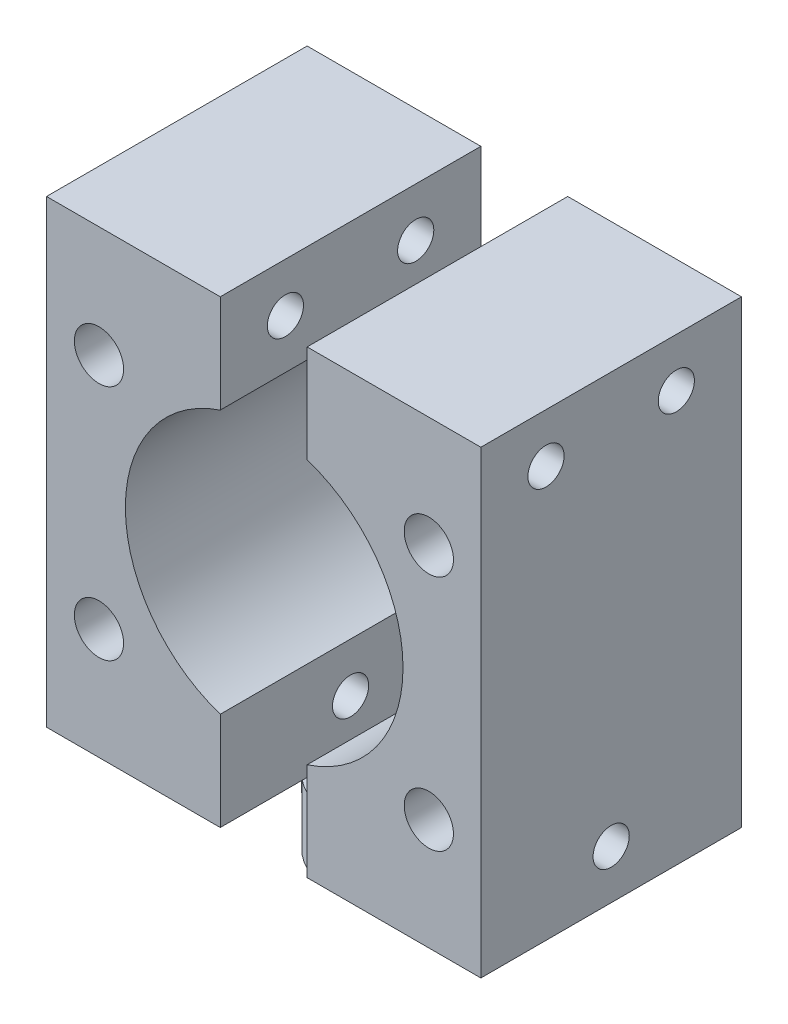
ISO-10303-21;
HEADER;
FILE_DESCRIPTION(('STEP AP214'),'2;1');
FILE_NAME('part.step','',(''),(''),'','','');
FILE_SCHEMA(('AUTOMOTIVE_DESIGN { 1 0 10303 214 1 1 1 1 }'));
ENDSEC;
DATA;
#1=APPLICATION_CONTEXT('core data for automotive mechanical design processes');
#2=APPLICATION_PROTOCOL_DEFINITION('international standard','automotive_design',2000,#1);
#3=PRODUCT_CONTEXT('',#1,'mechanical');
#4=PRODUCT('Part','Part','',(#3));
#5=PRODUCT_RELATED_PRODUCT_CATEGORY('part','',(#4));
#6=PRODUCT_DEFINITION_FORMATION('','',#4);
#7=PRODUCT_DEFINITION_CONTEXT('part definition',#1,'design');
#8=PRODUCT_DEFINITION('design','',#6,#7);
#9=PRODUCT_DEFINITION_SHAPE('','',#8);
#10=(LENGTH_UNIT() NAMED_UNIT(*) SI_UNIT(.MILLI.,.METRE.));
#11=(NAMED_UNIT(*) PLANE_ANGLE_UNIT() SI_UNIT($,.RADIAN.));
#12=(NAMED_UNIT(*) SI_UNIT($,.STERADIAN.) SOLID_ANGLE_UNIT());
#13=UNCERTAINTY_MEASURE_WITH_UNIT(LENGTH_MEASURE(1.E-05),#10,'distance_accuracy_value','');
#14=(GEOMETRIC_REPRESENTATION_CONTEXT(3) GLOBAL_UNCERTAINTY_ASSIGNED_CONTEXT((#13)) GLOBAL_UNIT_ASSIGNED_CONTEXT((#10,
#11,#12)) REPRESENTATION_CONTEXT('',''));
#15=CARTESIAN_POINT('',(0.,0.,0.));
#16=DIRECTION('',(0.,0.,1.));
#17=DIRECTION('',(1.,0.,0.));
#18=AXIS2_PLACEMENT_3D('',#15,#16,#17);
#19=CARTESIAN_POINT('',(-15.,4.5,-8.65612108217187));
#20=DIRECTION('',(0.,-1.,0.));
#21=DIRECTION('',(0.,0.,-1.));
#22=AXIS2_PLACEMENT_3D('',#19,#20,#21);
#23=PLANE('',#22);
#24=DIRECTION('',(0.,0.,-1.));
#25=VECTOR('',#24,1.);
#26=CARTESIAN_POINT('',(-3.,4.5,-8.65612108217187));
#27=LINE('',#26,#25);
#28=CARTESIAN_POINT('',(-3.,4.5,-3.68272996566406));
#29=VERTEX_POINT('',#28);
#30=CARTESIAN_POINT('',(-3.,4.5,-8.65612108217187));
#31=VERTEX_POINT('',#30);
#32=EDGE_CURVE('E209',#29,#31,#27,.T.);
#33=ORIENTED_EDGE('',*,*,#32,.F.);
#34=CARTESIAN_POINT('',(0.,4.5,0.));
#35=DIRECTION('',(0.,1.,0.));
#36=DIRECTION('',(0.,0.,1.));
#37=AXIS2_PLACEMENT_3D('',#34,#35,#36);
#38=CIRCLE('',#37,4.75);
#39=CARTESIAN_POINT('',(-3.,4.5,3.68272996566406));
#40=VERTEX_POINT('',#39);
#41=EDGE_CURVE('E146',#29,#40,#38,.T.);
#42=ORIENTED_EDGE('',*,*,#41,.T.);
#43=CARTESIAN_POINT('',(-3.,4.5,9.34387891782813));
#44=VERTEX_POINT('',#43);
#45=EDGE_CURVE('E199',#44,#40,#27,.T.);
#46=ORIENTED_EDGE('',*,*,#45,.F.);
#47=DIRECTION('',(1.,0.,0.));
#48=VECTOR('',#47,1.);
#49=CARTESIAN_POINT('',(-3.,4.5,9.34387891782813));
#50=LINE('',#49,#48);
#51=CARTESIAN_POINT('',(-15.,4.5,9.34387891782813));
#52=VERTEX_POINT('',#51);
#53=EDGE_CURVE('E208',#52,#44,#50,.T.);
#54=ORIENTED_EDGE('',*,*,#53,.F.);
#55=DIRECTION('',(0.,0.,1.));
#56=VECTOR('',#55,1.);
#57=CARTESIAN_POINT('',(-15.,4.5,9.34387891782813));
#58=LINE('',#57,#56);
#59=CARTESIAN_POINT('',(-15.,4.5,-8.65612108217187));
#60=VERTEX_POINT('',#59);
#61=EDGE_CURVE('E206',#60,#52,#58,.T.);
#62=ORIENTED_EDGE('',*,*,#61,.F.);
#63=DIRECTION('',(-1.,0.,0.));
#64=VECTOR('',#63,1.);
#65=CARTESIAN_POINT('',(-3.,4.5,-8.65612108217187));
#66=LINE('',#65,#64);
#67=EDGE_CURVE('E194',#31,#60,#66,.T.);
#68=ORIENTED_EDGE('',*,*,#67,.F.);
#69=EDGE_LOOP('',(#33,#42,#46,#54,#62,#68));
#70=FACE_BOUND('',#69,.T.);
#71=ADVANCED_FACE('F41',(#70),#23,.T.);
#72=CARTESIAN_POINT('',(-3.,36.25,-8.65612108217187));
#73=DIRECTION('',(0.,0.,1.));
#74=DIRECTION('',(1.,0.,0.));
#75=AXIS2_PLACEMENT_3D('',#72,#73,#74);
#76=PLANE('',#75);
#77=CARTESIAN_POINT('',(-11.3772186390947,28.569859147129,-8.65612108217187));
#78=DIRECTION('',(0.,0.,1.));
#79=DIRECTION('',(1.,0.,0.));
#80=AXIS2_PLACEMENT_3D('',#77,#78,#79);
#81=CIRCLE('',#80,1.7);
#82=CARTESIAN_POINT('',(-9.67721863909473,28.569859147129,-8.65612108217187));
#83=VERTEX_POINT('',#82);
#84=EDGE_CURVE('E169',#83,#83,#81,.T.);
#85=ORIENTED_EDGE('',*,*,#84,.T.);
#86=EDGE_LOOP('',(#85));
#87=FACE_BOUND('',#86,.T.);
#88=CARTESIAN_POINT('',(-11.3772186390947,12.180140852871,-8.65612108217187));
#89=DIRECTION('',(0.,0.,1.));
#90=DIRECTION('',(1.,0.,0.));
#91=AXIS2_PLACEMENT_3D('',#88,#89,#90);
#92=CIRCLE('',#91,1.7);
#93=CARTESIAN_POINT('',(-9.67721863909473,12.180140852871,-8.65612108217187));
#94=VERTEX_POINT('',#93);
#95=EDGE_CURVE('E130',#94,#94,#92,.T.);
#96=ORIENTED_EDGE('',*,*,#95,.T.);
#97=EDGE_LOOP('',(#96));
#98=FACE_BOUND('',#97,.T.);
#99=ORIENTED_EDGE('',*,*,#67,.T.);
#100=DIRECTION('',(0.,-1.,0.));
#101=VECTOR('',#100,1.);
#102=CARTESIAN_POINT('',(-15.,36.25,-8.65612108217187));
#103=LINE('',#102,#101);
#104=CARTESIAN_POINT('',(-15.,36.25,-8.65612108217187));
#105=VERTEX_POINT('',#104);
#106=EDGE_CURVE('E138',#105,#60,#103,.T.);
#107=ORIENTED_EDGE('',*,*,#106,.F.);
#108=DIRECTION('',(-1.,0.,0.));
#109=VECTOR('',#108,1.);
#110=CARTESIAN_POINT('',(-3.,36.25,-8.65612108217187));
#111=LINE('',#110,#109);
#112=CARTESIAN_POINT('',(-3.,36.25,-8.65612108217187));
#113=VERTEX_POINT('',#112);
#114=EDGE_CURVE('E195',#113,#105,#111,.T.);
#115=ORIENTED_EDGE('',*,*,#114,.F.);
#116=DIRECTION('',(0.,-1.,0.));
#117=VECTOR('',#116,1.);
#118=CARTESIAN_POINT('',(-3.,36.25,-8.65612108217187));
#119=LINE('',#118,#117);
#120=EDGE_CURVE('E140',#113,#31,#119,.T.);
#121=ORIENTED_EDGE('',*,*,#120,.T.);
#122=EDGE_LOOP('',(#99,#107,#115,#121));
#123=FACE_BOUND('',#122,.T.);
#124=ADVANCED_FACE('F43',(#87,#98,#123),#76,.F.);
#125=CARTESIAN_POINT('',(-15.,36.25,9.34387891782813));
#126=DIRECTION('',(1.,0.,0.));
#127=DIRECTION('',(0.,0.,-1.));
#128=AXIS2_PLACEMENT_3D('',#125,#126,#127);
#129=PLANE('',#128);
#130=CARTESIAN_POINT('',(-15.,32.8715786406462,4.84387891782813));
#131=DIRECTION('',(1.,0.,0.));
#132=DIRECTION('',(0.,0.,-1.));
#133=AXIS2_PLACEMENT_3D('',#130,#131,#132);
#134=CIRCLE('',#133,1.24999999999998);
#135=CARTESIAN_POINT('',(-15.,32.8715786406462,3.59387891782815));
#136=VERTEX_POINT('',#135);
#137=EDGE_CURVE('E164',#136,#136,#134,.T.);
#138=ORIENTED_EDGE('',*,*,#137,.T.);
#139=EDGE_LOOP('',(#138));
#140=FACE_BOUND('',#139,.T.);
#141=CARTESIAN_POINT('',(-15.,32.8715786406462,-4.15612108217187));
#142=DIRECTION('',(1.,0.,0.));
#143=DIRECTION('',(0.,0.,-1.));
#144=AXIS2_PLACEMENT_3D('',#141,#142,#143);
#145=CIRCLE('',#144,1.24999999999998);
#146=CARTESIAN_POINT('',(-15.,32.8715786406462,-5.40612108217185));
#147=VERTEX_POINT('',#146);
#148=EDGE_CURVE('E154',#147,#147,#145,.T.);
#149=ORIENTED_EDGE('',*,*,#148,.T.);
#150=EDGE_LOOP('',(#149));
#151=FACE_BOUND('',#150,.T.);
#152=CARTESIAN_POINT('',(-15.,7.87842135935374,0.34387891782813));
#153=DIRECTION('',(1.,0.,0.));
#154=DIRECTION('',(0.,0.,-1.));
#155=AXIS2_PLACEMENT_3D('',#152,#153,#154);
#156=CIRCLE('',#155,1.24999999999998);
#157=CARTESIAN_POINT('',(-15.,7.87842135935374,-0.906121082171854));
#158=VERTEX_POINT('',#157);
#159=EDGE_CURVE('E151',#158,#158,#156,.T.);
#160=ORIENTED_EDGE('',*,*,#159,.T.);
#161=EDGE_LOOP('',(#160));
#162=FACE_BOUND('',#161,.T.);
#163=ORIENTED_EDGE('',*,*,#61,.T.);
#164=DIRECTION('',(0.,-1.,0.));
#165=VECTOR('',#164,1.);
#166=CARTESIAN_POINT('',(-15.,36.25,9.34387891782813));
#167=LINE('',#166,#165);
#168=CARTESIAN_POINT('',(-15.,36.25,9.34387891782813));
#169=VERTEX_POINT('',#168);
#170=EDGE_CURVE('E135',#169,#52,#167,.T.);
#171=ORIENTED_EDGE('',*,*,#170,.F.);
#172=DIRECTION('',(0.,0.,1.));
#173=VECTOR('',#172,1.);
#174=CARTESIAN_POINT('',(-15.,36.25,9.34387891782813));
#175=LINE('',#174,#173);
#176=EDGE_CURVE('E198',#105,#169,#175,.T.);
#177=ORIENTED_EDGE('',*,*,#176,.F.);
#178=ORIENTED_EDGE('',*,*,#106,.T.);
#179=EDGE_LOOP('',(#163,#171,#177,#178));
#180=FACE_BOUND('',#179,.T.);
#181=ADVANCED_FACE('F225',(#140,#151,#162,#180),#129,.F.);
#182=CARTESIAN_POINT('',(-3.,36.25,9.34387891782813));
#183=DIRECTION('',(0.,0.,-1.));
#184=DIRECTION('',(-1.,0.,0.));
#185=AXIS2_PLACEMENT_3D('',#182,#183,#184);
#186=PLANE('',#185);
#187=CARTESIAN_POINT('',(-11.3772186390947,28.569859147129,9.34387891782813));
#188=DIRECTION('',(0.,0.,1.));
#189=DIRECTION('',(1.,0.,0.));
#190=AXIS2_PLACEMENT_3D('',#187,#188,#189);
#191=CIRCLE('',#190,1.69999999999999);
#192=CARTESIAN_POINT('',(-9.67721863909474,28.569859147129,9.34387891782813));
#193=VERTEX_POINT('',#192);
#194=EDGE_CURVE('E150',#193,#193,#191,.T.);
#195=ORIENTED_EDGE('',*,*,#194,.F.);
#196=EDGE_LOOP('',(#195));
#197=FACE_BOUND('',#196,.T.);
#198=CARTESIAN_POINT('',(-11.3772186390947,12.180140852871,9.34387891782813));
#199=DIRECTION('',(0.,0.,1.));
#200=DIRECTION('',(1.,0.,0.));
#201=AXIS2_PLACEMENT_3D('',#198,#199,#200);
#202=CIRCLE('',#201,1.69999999999999);
#203=CARTESIAN_POINT('',(-9.67721863909474,12.180140852871,9.34387891782813));
#204=VERTEX_POINT('',#203);
#205=EDGE_CURVE('E172',#204,#204,#202,.T.);
#206=ORIENTED_EDGE('',*,*,#205,.F.);
#207=EDGE_LOOP('',(#206));
#208=FACE_BOUND('',#207,.T.);
#209=DIRECTION('',(0.,-1.,0.));
#210=VECTOR('',#209,1.);
#211=CARTESIAN_POINT('',(-3.,36.25,9.34387891782813));
#212=LINE('',#211,#210);
#213=CARTESIAN_POINT('',(-3.,11.2790892751317,9.34387891782813));
#214=VERTEX_POINT('',#213);
#215=EDGE_CURVE('E129',#214,#44,#212,.T.);
#216=ORIENTED_EDGE('',*,*,#215,.F.);
#217=CARTESIAN_POINT('',(0.0337666909677441,20.375,9.34387891782813));
#218=DIRECTION('',(0.,0.,1.));
#219=DIRECTION('',(1.,0.,0.));
#220=AXIS2_PLACEMENT_3D('',#217,#218,#219);
#221=CIRCLE('',#220,9.5885);
#222=CARTESIAN_POINT('',(-3.,29.4709107248683,9.34387891782813));
#223=VERTEX_POINT('',#222);
#224=EDGE_CURVE('E115',#223,#214,#221,.T.);
#225=ORIENTED_EDGE('',*,*,#224,.F.);
#226=CARTESIAN_POINT('',(-3.,36.25,9.34387891782813));
#227=VERTEX_POINT('',#226);
#228=EDGE_CURVE('E126',#227,#223,#212,.T.);
#229=ORIENTED_EDGE('',*,*,#228,.F.);
#230=DIRECTION('',(1.,0.,0.));
#231=VECTOR('',#230,1.);
#232=CARTESIAN_POINT('',(-3.,36.25,9.34387891782813));
#233=LINE('',#232,#231);
#234=EDGE_CURVE('E201',#169,#227,#233,.T.);
#235=ORIENTED_EDGE('',*,*,#234,.F.);
#236=ORIENTED_EDGE('',*,*,#170,.T.);
#237=ORIENTED_EDGE('',*,*,#53,.T.);
#238=EDGE_LOOP('',(#216,#225,#229,#235,#236,#237));
#239=FACE_BOUND('',#238,.T.);
#240=ADVANCED_FACE('F124',(#197,#208,#239),#186,.F.);
#241=CARTESIAN_POINT('',(-3.,36.25,-8.65612108217187));
#242=DIRECTION('',(-1.,0.,0.));
#243=DIRECTION('',(0.,0.,1.));
#244=AXIS2_PLACEMENT_3D('',#241,#242,#243);
#245=PLANE('',#244);
#246=CARTESIAN_POINT('',(-3.,32.8715786406462,4.84387891782813));
#247=DIRECTION('',(-1.,0.,0.));
#248=DIRECTION('',(0.,0.,1.));
#249=AXIS2_PLACEMENT_3D('',#246,#247,#248);
#250=CIRCLE('',#249,1.24999999999998);
#251=CARTESIAN_POINT('',(-3.,32.8715786406462,6.09387891782811));
#252=VERTEX_POINT('',#251);
#253=EDGE_CURVE('E45',#252,#252,#250,.T.);
#254=ORIENTED_EDGE('',*,*,#253,.T.);
#255=EDGE_LOOP('',(#254));
#256=FACE_BOUND('',#255,.T.);
#257=CARTESIAN_POINT('',(-3.,32.8715786406462,-4.15612108217187));
#258=DIRECTION('',(-1.,0.,0.));
#259=DIRECTION('',(0.,0.,1.));
#260=AXIS2_PLACEMENT_3D('',#257,#258,#259);
#261=CIRCLE('',#260,1.24999999999998);
#262=CARTESIAN_POINT('',(-3.,32.8715786406462,-2.90612108217189));
#263=VERTEX_POINT('',#262);
#264=EDGE_CURVE('E152',#263,#263,#261,.T.);
#265=ORIENTED_EDGE('',*,*,#264,.T.);
#266=EDGE_LOOP('',(#265));
#267=FACE_BOUND('',#266,.T.);
#268=CARTESIAN_POINT('',(-3.,7.87842135935374,0.34387891782813));
#269=DIRECTION('',(-1.,0.,0.));
#270=DIRECTION('',(0.,0.,1.));
#271=AXIS2_PLACEMENT_3D('',#268,#269,#270);
#272=CIRCLE('',#271,1.24999999999999);
#273=CARTESIAN_POINT('',(-3.,7.87842135935374,1.59387891782812));
#274=VERTEX_POINT('',#273);
#275=EDGE_CURVE('E148',#274,#274,#272,.T.);
#276=ORIENTED_EDGE('',*,*,#275,.T.);
#277=EDGE_LOOP('',(#276));
#278=FACE_BOUND('',#277,.T.);
#279=DIRECTION('',(0.,1.,0.));
#280=VECTOR('',#279,1.);
#281=CARTESIAN_POINT('',(-3.,36.25,-7.65612108217187));
#282=LINE('',#281,#280);
#283=CARTESIAN_POINT('',(-3.,11.2790892751317,-7.65612108217187));
#284=VERTEX_POINT('',#283);
#285=CARTESIAN_POINT('',(-3.,29.4709107248683,-7.65612108217187));
#286=VERTEX_POINT('',#285);
#287=EDGE_CURVE('E119',#284,#286,#282,.T.);
#288=ORIENTED_EDGE('',*,*,#287,.F.);
#289=DIRECTION('',(0.,0.,1.));
#290=VECTOR('',#289,1.);
#291=CARTESIAN_POINT('',(-3.,11.2790892751317,-7.65612108217187));
#292=LINE('',#291,#290);
#293=EDGE_CURVE('E12',#284,#214,#292,.T.);
#294=ORIENTED_EDGE('',*,*,#293,.T.);
#295=ORIENTED_EDGE('',*,*,#215,.T.);
#296=ORIENTED_EDGE('',*,*,#45,.T.);
#297=EDGE_CURVE('E211',#40,#29,#27,.T.);
#298=ORIENTED_EDGE('',*,*,#297,.T.);
#299=ORIENTED_EDGE('',*,*,#32,.T.);
#300=ORIENTED_EDGE('',*,*,#120,.F.);
#301=DIRECTION('',(0.,0.,-1.));
#302=VECTOR('',#301,1.);
#303=CARTESIAN_POINT('',(-3.,36.25,-8.65612108217187));
#304=LINE('',#303,#302);
#305=EDGE_CURVE('E134',#227,#113,#304,.T.);
#306=ORIENTED_EDGE('',*,*,#305,.F.);
#307=ORIENTED_EDGE('',*,*,#228,.T.);
#308=DIRECTION('',(0.,0.,1.));
#309=VECTOR('',#308,1.);
#310=CARTESIAN_POINT('',(-3.,29.4709107248683,-7.65612108217187));
#311=LINE('',#310,#309);
#312=EDGE_CURVE('E50',#223,#286,#311,.F.);
#313=ORIENTED_EDGE('',*,*,#312,.T.);
#314=EDGE_LOOP('',(#288,#294,#295,#296,#298,#299,#300,#306,#307,#313));
#315=FACE_BOUND('',#314,.T.);
#316=ADVANCED_FACE('F132',(#256,#267,#278,#315),#245,.F.);
#317=CARTESIAN_POINT('',(-15.,36.25,-8.65612108217187));
#318=DIRECTION('',(0.,-1.,0.));
#319=DIRECTION('',(0.,0.,-1.));
#320=AXIS2_PLACEMENT_3D('',#317,#318,#319);
#321=PLANE('',#320);
#322=ORIENTED_EDGE('',*,*,#114,.T.);
#323=ORIENTED_EDGE('',*,*,#176,.T.);
#324=ORIENTED_EDGE('',*,*,#234,.T.);
#325=ORIENTED_EDGE('',*,*,#305,.T.);
#326=EDGE_LOOP('',(#322,#323,#324,#325));
#327=FACE_BOUND('',#326,.T.);
#328=ADVANCED_FACE('F227',(#327),#321,.F.);
#329=CARTESIAN_POINT('',(-10.5914213562373,4.5,0.));
#330=DIRECTION('',(0.,1.,0.));
#331=DIRECTION('',(0.,0.,1.));
#332=AXIS2_PLACEMENT_3D('',#329,#330,#331);
#333=PLANE('',#332);
#334=ORIENTED_EDGE('',*,*,#297,.F.);
#335=CARTESIAN_POINT('',(-1.5,4.5,4.50693909432999));
#336=VERTEX_POINT('',#335);
#337=EDGE_CURVE('E65',#40,#336,#38,.T.);
#338=ORIENTED_EDGE('',*,*,#337,.T.);
#339=DIRECTION('',(0.,0.,1.));
#340=VECTOR('',#339,1.);
#341=CARTESIAN_POINT('',(-1.5,4.5,0.));
#342=LINE('',#341,#340);
#343=CARTESIAN_POINT('',(-1.5,4.5,-4.50693909432999));
#344=VERTEX_POINT('',#343);
#345=EDGE_CURVE('E179',#344,#336,#342,.T.);
#346=ORIENTED_EDGE('',*,*,#345,.F.);
#347=EDGE_CURVE('E183',#344,#29,#38,.T.);
#348=ORIENTED_EDGE('',*,*,#347,.T.);
#349=EDGE_LOOP('',(#334,#338,#346,#348));
#350=FACE_BOUND('',#349,.T.);
#351=ADVANCED_FACE('F231',(#350),#333,.T.);
#352=CARTESIAN_POINT('',(-1.5,4.5,0.));
#353=DIRECTION('',(1.,0.,0.));
#354=DIRECTION('',(0.,0.,-1.));
#355=AXIS2_PLACEMENT_3D('',#352,#353,#354);
#356=PLANE('',#355);
#357=DIRECTION('',(0.,0.,1.));
#358=VECTOR('',#357,1.);
#359=CARTESIAN_POINT('',(-1.5,0.,0.));
#360=LINE('',#359,#358);
#361=CARTESIAN_POINT('',(-1.5,0.,-4.50693909432999));
#362=VERTEX_POINT('',#361);
#363=CARTESIAN_POINT('',(-1.5,0.,4.50693909432999));
#364=VERTEX_POINT('',#363);
#365=EDGE_CURVE('E177',#362,#364,#360,.T.);
#366=ORIENTED_EDGE('',*,*,#365,.F.);
#367=DIRECTION('',(0.,-1.,0.));
#368=VECTOR('',#367,1.);
#369=CARTESIAN_POINT('',(-1.5,4.5,-4.50693909432999));
#370=LINE('',#369,#368);
#371=EDGE_CURVE('E192',#344,#362,#370,.T.);
#372=ORIENTED_EDGE('',*,*,#371,.F.);
#373=ORIENTED_EDGE('',*,*,#345,.T.);
#374=DIRECTION('',(0.,-1.,0.));
#375=VECTOR('',#374,1.);
#376=CARTESIAN_POINT('',(-1.5,4.5,4.50693909432999));
#377=LINE('',#376,#375);
#378=EDGE_CURVE('E186',#336,#364,#377,.T.);
#379=ORIENTED_EDGE('',*,*,#378,.T.);
#380=EDGE_LOOP('',(#366,#372,#373,#379));
#381=FACE_BOUND('',#380,.T.);
#382=ADVANCED_FACE('F236',(#381),#356,.T.);
#383=CARTESIAN_POINT('',(0.,4.5,0.));
#384=DIRECTION('',(0.,-1.,0.));
#385=DIRECTION('',(0.,0.,-1.));
#386=AXIS2_PLACEMENT_3D('',#383,#384,#385);
#387=CYLINDRICAL_SURFACE('',#386,4.75);
#388=CARTESIAN_POINT('',(0.,0.,0.));
#389=DIRECTION('',(0.,1.,0.));
#390=DIRECTION('',(0.,0.,1.));
#391=AXIS2_PLACEMENT_3D('',#388,#389,#390);
#392=CIRCLE('',#391,4.75);
#393=EDGE_CURVE('E182',#362,#364,#392,.T.);
#394=ORIENTED_EDGE('',*,*,#393,.T.);
#395=ORIENTED_EDGE('',*,*,#378,.F.);
#396=ORIENTED_EDGE('',*,*,#337,.F.);
#397=ORIENTED_EDGE('',*,*,#41,.F.);
#398=ORIENTED_EDGE('',*,*,#347,.F.);
#399=ORIENTED_EDGE('',*,*,#371,.T.);
#400=EDGE_LOOP('',(#394,#395,#396,#397,#398,#399));
#401=FACE_BOUND('',#400,.T.);
#402=ADVANCED_FACE('F232',(#401),#387,.T.);
#403=CARTESIAN_POINT('',(-10.5914213562373,0.,0.));
#404=DIRECTION('',(0.,1.,0.));
#405=DIRECTION('',(0.,0.,1.));
#406=AXIS2_PLACEMENT_3D('',#403,#404,#405);
#407=PLANE('',#406);
#408=ORIENTED_EDGE('',*,*,#365,.T.);
#409=ORIENTED_EDGE('',*,*,#393,.F.);
#410=EDGE_LOOP('',(#408,#409));
#411=FACE_BOUND('',#410,.T.);
#412=ADVANCED_FACE('F238',(#411),#407,.F.);
#413=CARTESIAN_POINT('',(0.0337666909677441,20.375,-7.65612108217187));
#414=DIRECTION('',(0.,0.,1.));
#415=DIRECTION('',(1.,0.,0.));
#416=AXIS2_PLACEMENT_3D('',#413,#414,#415);
#417=CYLINDRICAL_SURFACE('',#416,9.5885);
#418=CARTESIAN_POINT('',(0.0337666909677441,20.375,-7.65612108217187));
#419=DIRECTION('',(0.,0.,1.));
#420=DIRECTION('',(1.,0.,0.));
#421=AXIS2_PLACEMENT_3D('',#418,#419,#420);
#422=CIRCLE('',#421,9.5885);
#423=EDGE_CURVE('E57',#286,#284,#422,.T.);
#424=ORIENTED_EDGE('',*,*,#423,.F.);
#425=ORIENTED_EDGE('',*,*,#312,.F.);
#426=ORIENTED_EDGE('',*,*,#224,.T.);
#427=ORIENTED_EDGE('',*,*,#293,.F.);
#428=EDGE_LOOP('',(#424,#425,#426,#427));
#429=FACE_BOUND('',#428,.T.);
#430=ADVANCED_FACE('F114',(#429),#417,.F.);
#431=CARTESIAN_POINT('',(0.0337666909677441,20.375,-7.65612108217187));
#432=DIRECTION('',(0.,0.,1.));
#433=DIRECTION('',(1.,0.,0.));
#434=AXIS2_PLACEMENT_3D('',#431,#432,#433);
#435=PLANE('',#434);
#436=ORIENTED_EDGE('',*,*,#287,.T.);
#437=ORIENTED_EDGE('',*,*,#423,.T.);
#438=EDGE_LOOP('',(#436,#437));
#439=FACE_BOUND('',#438,.T.);
#440=ADVANCED_FACE('F245',(#439),#435,.T.);
#441=CARTESIAN_POINT('',(-11.3772186390947,12.180140852871,9.34387891782813));
#442=DIRECTION('',(0.,0.,1.));
#443=DIRECTION('',(1.,0.,0.));
#444=AXIS2_PLACEMENT_3D('',#441,#442,#443);
#445=CYLINDRICAL_SURFACE('',#444,1.69999999999999);
#446=ORIENTED_EDGE('',*,*,#95,.F.);
#447=EDGE_LOOP('',(#446));
#448=FACE_BOUND('',#447,.T.);
#449=ORIENTED_EDGE('',*,*,#205,.T.);
#450=EDGE_LOOP('',(#449));
#451=FACE_BOUND('',#450,.T.);
#452=ADVANCED_FACE('F287',(#448,#451),#445,.F.);
#453=CARTESIAN_POINT('',(-11.3772186390947,28.569859147129,9.34387891782813));
#454=DIRECTION('',(0.,0.,1.));
#455=DIRECTION('',(1.,0.,0.));
#456=AXIS2_PLACEMENT_3D('',#453,#454,#455);
#457=CYLINDRICAL_SURFACE('',#456,1.69999999999999);
#458=ORIENTED_EDGE('',*,*,#84,.F.);
#459=EDGE_LOOP('',(#458));
#460=FACE_BOUND('',#459,.T.);
#461=ORIENTED_EDGE('',*,*,#194,.T.);
#462=EDGE_LOOP('',(#461));
#463=FACE_BOUND('',#462,.T.);
#464=ADVANCED_FACE('F276',(#460,#463),#457,.F.);
#465=CARTESIAN_POINT('',(15.,7.87842135935374,0.34387891782813));
#466=DIRECTION('',(1.,0.,0.));
#467=DIRECTION('',(0.,0.,-1.));
#468=AXIS2_PLACEMENT_3D('',#465,#466,#467);
#469=CYLINDRICAL_SURFACE('',#468,1.24999999999999);
#470=ORIENTED_EDGE('',*,*,#159,.F.);
#471=EDGE_LOOP('',(#470));
#472=FACE_BOUND('',#471,.T.);
#473=ORIENTED_EDGE('',*,*,#275,.F.);
#474=EDGE_LOOP('',(#473));
#475=FACE_BOUND('',#474,.T.);
#476=ADVANCED_FACE('F272',(#472,#475),#469,.F.);
#477=CARTESIAN_POINT('',(15.,32.8715786406462,-4.15612108217187));
#478=DIRECTION('',(1.,0.,0.));
#479=DIRECTION('',(0.,0.,-1.));
#480=AXIS2_PLACEMENT_3D('',#477,#478,#479);
#481=CYLINDRICAL_SURFACE('',#480,1.24999999999998);
#482=ORIENTED_EDGE('',*,*,#148,.F.);
#483=EDGE_LOOP('',(#482));
#484=FACE_BOUND('',#483,.T.);
#485=ORIENTED_EDGE('',*,*,#264,.F.);
#486=EDGE_LOOP('',(#485));
#487=FACE_BOUND('',#486,.T.);
#488=ADVANCED_FACE('F275',(#484,#487),#481,.F.);
#489=CARTESIAN_POINT('',(15.,32.8715786406462,4.84387891782813));
#490=DIRECTION('',(1.,0.,0.));
#491=DIRECTION('',(0.,0.,-1.));
#492=AXIS2_PLACEMENT_3D('',#489,#490,#491);
#493=CYLINDRICAL_SURFACE('',#492,1.24999999999998);
#494=ORIENTED_EDGE('',*,*,#137,.F.);
#495=EDGE_LOOP('',(#494));
#496=FACE_BOUND('',#495,.T.);
#497=ORIENTED_EDGE('',*,*,#253,.F.);
#498=EDGE_LOOP('',(#497));
#499=FACE_BOUND('',#498,.T.);
#500=ADVANCED_FACE('F284',(#496,#499),#493,.F.);
#501=CLOSED_SHELL('',(#71,#124,#181,#240,#316,#328,#351,#382,#402,#412,#430,#440,#452,#464,#476,
#488,#500));
#502=MANIFOLD_SOLID_BREP('B2',#501);
#503=CARTESIAN_POINT('',(3.,36.25,-8.65612108217187));
#504=DIRECTION('',(0.,0.,1.));
#505=DIRECTION('',(1.,0.,0.));
#506=AXIS2_PLACEMENT_3D('',#503,#504,#505);
#507=PLANE('',#506);
#508=CARTESIAN_POINT('',(11.4050067096299,12.171834609744,-8.65612108217187));
#509=DIRECTION('',(0.,0.,1.));
#510=DIRECTION('',(1.,0.,0.));
#511=AXIS2_PLACEMENT_3D('',#508,#509,#510);
#512=CIRCLE('',#511,1.7);
#513=CARTESIAN_POINT('',(13.1050067096299,12.171834609744,-8.65612108217187));
#514=VERTEX_POINT('',#513);
#515=EDGE_CURVE('E596',#514,#514,#512,.T.);
#516=ORIENTED_EDGE('',*,*,#515,.T.);
#517=EDGE_LOOP('',(#516));
#518=FACE_BOUND('',#517,.T.);
#519=CARTESIAN_POINT('',(11.4050067096299,28.578165390256,-8.65612108217187));
#520=DIRECTION('',(0.,0.,1.));
#521=DIRECTION('',(1.,0.,0.));
#522=AXIS2_PLACEMENT_3D('',#519,#520,#521);
#523=CIRCLE('',#522,1.7);
#524=CARTESIAN_POINT('',(13.1050067096299,28.578165390256,-8.65612108217187));
#525=VERTEX_POINT('',#524);
#526=EDGE_CURVE('E490',#525,#525,#523,.T.);
#527=ORIENTED_EDGE('',*,*,#526,.T.);
#528=EDGE_LOOP('',(#527));
#529=FACE_BOUND('',#528,.T.);
#530=DIRECTION('',(-1.,0.,0.));
#531=VECTOR('',#530,1.);
#532=CARTESIAN_POINT('',(3.,4.5,-8.65612108217187));
#533=LINE('',#532,#531);
#534=CARTESIAN_POINT('',(15.,4.5,-8.65612108217187));
#535=VERTEX_POINT('',#534);
#536=CARTESIAN_POINT('',(3.,4.5,-8.65612108217187));
#537=VERTEX_POINT('',#536);
#538=EDGE_CURVE('E516',#535,#537,#533,.T.);
#539=ORIENTED_EDGE('',*,*,#538,.T.);
#540=DIRECTION('',(0.,-1.,0.));
#541=VECTOR('',#540,1.);
#542=CARTESIAN_POINT('',(3.,36.25,-8.65612108217187));
#543=LINE('',#542,#541);
#544=CARTESIAN_POINT('',(3.,36.25,-8.65612108217187));
#545=VERTEX_POINT('',#544);
#546=EDGE_CURVE('E545',#545,#537,#543,.T.);
#547=ORIENTED_EDGE('',*,*,#546,.F.);
#548=DIRECTION('',(-1.,0.,0.));
#549=VECTOR('',#548,1.);
#550=CARTESIAN_POINT('',(3.,36.25,-8.65612108217187));
#551=LINE('',#550,#549);
#552=CARTESIAN_POINT('',(15.,36.25,-8.65612108217187));
#553=VERTEX_POINT('',#552);
#554=EDGE_CURVE('E517',#553,#545,#551,.T.);
#555=ORIENTED_EDGE('',*,*,#554,.F.);
#556=DIRECTION('',(0.,-1.,0.));
#557=VECTOR('',#556,1.);
#558=CARTESIAN_POINT('',(15.,36.25,-8.65612108217187));
#559=LINE('',#558,#557);
#560=EDGE_CURVE('E527',#553,#535,#559,.T.);
#561=ORIENTED_EDGE('',*,*,#560,.T.);
#562=EDGE_LOOP('',(#539,#547,#555,#561));
#563=FACE_BOUND('',#562,.T.);
#564=ADVANCED_FACE('F409',(#518,#529,#563),#507,.F.);
#565=CARTESIAN_POINT('',(3.,36.25,-8.65612108217187));
#566=DIRECTION('',(1.,0.,0.));
#567=DIRECTION('',(0.,0.,-1.));
#568=AXIS2_PLACEMENT_3D('',#565,#566,#567);
#569=PLANE('',#568);
#570=CARTESIAN_POINT('',(3.,32.8715786406462,4.84387891782813));
#571=DIRECTION('',(1.,0.,0.));
#572=DIRECTION('',(0.,0.,-1.));
#573=AXIS2_PLACEMENT_3D('',#570,#571,#572);
#574=CIRCLE('',#573,1.24999999999998);
#575=CARTESIAN_POINT('',(3.,32.8715786406462,3.59387891782815));
#576=VERTEX_POINT('',#575);
#577=EDGE_CURVE('E617',#576,#576,#574,.T.);
#578=ORIENTED_EDGE('',*,*,#577,.T.);
#579=EDGE_LOOP('',(#578));
#580=FACE_BOUND('',#579,.T.);
#581=CARTESIAN_POINT('',(3.,32.8715786406462,-4.15612108217187));
#582=DIRECTION('',(1.,0.,0.));
#583=DIRECTION('',(0.,0.,-1.));
#584=AXIS2_PLACEMENT_3D('',#581,#582,#583);
#585=CIRCLE('',#584,1.24999999999998);
#586=CARTESIAN_POINT('',(3.,32.8715786406462,-5.40612108217185));
#587=VERTEX_POINT('',#586);
#588=EDGE_CURVE('E611',#587,#587,#585,.T.);
#589=ORIENTED_EDGE('',*,*,#588,.T.);
#590=EDGE_LOOP('',(#589));
#591=FACE_BOUND('',#590,.T.);
#592=CARTESIAN_POINT('',(3.,7.87842135935374,0.34387891782813));
#593=DIRECTION('',(1.,0.,0.));
#594=DIRECTION('',(0.,0.,-1.));
#595=AXIS2_PLACEMENT_3D('',#592,#593,#594);
#596=CIRCLE('',#595,1.24999999999999);
#597=CARTESIAN_POINT('',(3.,7.87842135935374,-0.906121082171855));
#598=VERTEX_POINT('',#597);
#599=EDGE_CURVE('E412',#598,#598,#596,.T.);
#600=ORIENTED_EDGE('',*,*,#599,.T.);
#601=EDGE_LOOP('',(#600));
#602=FACE_BOUND('',#601,.T.);
#603=DIRECTION('',(0.,-1.,0.));
#604=VECTOR('',#603,1.);
#605=CARTESIAN_POINT('',(3.,36.25,-7.65612108217187));
#606=LINE('',#605,#604);
#607=CARTESIAN_POINT('',(3.,29.4931572812925,-7.65612108217187));
#608=VERTEX_POINT('',#607);
#609=CARTESIAN_POINT('',(3.,11.2568427187075,-7.65612108217187));
#610=VERTEX_POINT('',#609);
#611=EDGE_CURVE('E39',#608,#610,#606,.T.);
#612=ORIENTED_EDGE('',*,*,#611,.F.);
#613=DIRECTION('',(0.,0.,1.));
#614=VECTOR('',#613,1.);
#615=CARTESIAN_POINT('',(3.,29.4931572812925,-7.65612108217187));
#616=LINE('',#615,#614);
#617=CARTESIAN_POINT('',(3.,29.4931572812925,9.34387891782813));
#618=VERTEX_POINT('',#617);
#619=EDGE_CURVE('E478',#608,#618,#616,.T.);
#620=ORIENTED_EDGE('',*,*,#619,.T.);
#621=DIRECTION('',(0.,-1.,0.));
#622=VECTOR('',#621,1.);
#623=CARTESIAN_POINT('',(3.,36.25,9.34387891782813));
#624=LINE('',#623,#622);
#625=CARTESIAN_POINT('',(3.,36.25,9.34387891782813));
#626=VERTEX_POINT('',#625);
#627=EDGE_CURVE('E543',#626,#618,#624,.T.);
#628=ORIENTED_EDGE('',*,*,#627,.F.);
#629=DIRECTION('',(0.,0.,1.));
#630=VECTOR('',#629,1.);
#631=CARTESIAN_POINT('',(3.,36.25,-8.65612108217187));
#632=LINE('',#631,#630);
#633=EDGE_CURVE('E520',#545,#626,#632,.T.);
#634=ORIENTED_EDGE('',*,*,#633,.F.);
#635=ORIENTED_EDGE('',*,*,#546,.T.);
#636=DIRECTION('',(0.,0.,1.));
#637=VECTOR('',#636,1.);
#638=CARTESIAN_POINT('',(3.,4.5,-8.65612108217187));
#639=LINE('',#638,#637);
#640=CARTESIAN_POINT('',(3.,4.5,-3.68272996566406));
#641=VERTEX_POINT('',#640);
#642=EDGE_CURVE('E531',#537,#641,#639,.T.);
#643=ORIENTED_EDGE('',*,*,#642,.T.);
#644=CARTESIAN_POINT('',(3.,4.5,3.68272996566406));
#645=VERTEX_POINT('',#644);
#646=EDGE_CURVE('E535',#641,#645,#639,.T.);
#647=ORIENTED_EDGE('',*,*,#646,.T.);
#648=CARTESIAN_POINT('',(3.,4.5,9.34387891782813));
#649=VERTEX_POINT('',#648);
#650=EDGE_CURVE('E530',#645,#649,#639,.T.);
#651=ORIENTED_EDGE('',*,*,#650,.T.);
#652=CARTESIAN_POINT('',(3.,11.2568427187075,9.34387891782813));
#653=VERTEX_POINT('',#652);
#654=EDGE_CURVE('E495',#653,#649,#624,.T.);
#655=ORIENTED_EDGE('',*,*,#654,.F.);
#656=DIRECTION('',(0.,0.,1.));
#657=VECTOR('',#656,1.);
#658=CARTESIAN_POINT('',(3.,11.2568427187075,-7.65612108217187));
#659=LINE('',#658,#657);
#660=EDGE_CURVE('E424',#653,#610,#659,.F.);
#661=ORIENTED_EDGE('',*,*,#660,.T.);
#662=EDGE_LOOP('',(#612,#620,#628,#634,#635,#643,#647,#651,#655,#661));
#663=FACE_BOUND('',#662,.T.);
#664=ADVANCED_FACE('F492',(#580,#591,#602,#663),#569,.F.);
#665=CARTESIAN_POINT('',(3.,36.25,9.34387891782813));
#666=DIRECTION('',(0.,0.,-1.));
#667=DIRECTION('',(-1.,0.,0.));
#668=AXIS2_PLACEMENT_3D('',#665,#666,#667);
#669=PLANE('',#668);
#670=CARTESIAN_POINT('',(11.4050067096299,12.171834609744,9.34387891782813));
#671=DIRECTION('',(0.,0.,1.));
#672=DIRECTION('',(1.,0.,0.));
#673=AXIS2_PLACEMENT_3D('',#670,#671,#672);
#674=CIRCLE('',#673,1.69999999999999);
#675=CARTESIAN_POINT('',(13.1050067096299,12.171834609744,9.34387891782813));
#676=VERTEX_POINT('',#675);
#677=EDGE_CURVE('E605',#676,#676,#674,.T.);
#678=ORIENTED_EDGE('',*,*,#677,.F.);
#679=EDGE_LOOP('',(#678));
#680=FACE_BOUND('',#679,.T.);
#681=CARTESIAN_POINT('',(11.4050067096299,28.578165390256,9.34387891782813));
#682=DIRECTION('',(0.,0.,1.));
#683=DIRECTION('',(1.,0.,0.));
#684=AXIS2_PLACEMENT_3D('',#681,#682,#683);
#685=CIRCLE('',#684,1.69999999999999);
#686=CARTESIAN_POINT('',(13.1050067096299,28.578165390256,9.34387891782813));
#687=VERTEX_POINT('',#686);
#688=EDGE_CURVE('E600',#687,#687,#685,.T.);
#689=ORIENTED_EDGE('',*,*,#688,.F.);
#690=EDGE_LOOP('',(#689));
#691=FACE_BOUND('',#690,.T.);
#692=ORIENTED_EDGE('',*,*,#627,.T.);
#693=CARTESIAN_POINT('',(0.0337666909677441,20.375,9.34387891782813));
#694=DIRECTION('',(0.,0.,-1.));
#695=DIRECTION('',(-1.,0.,0.));
#696=AXIS2_PLACEMENT_3D('',#693,#694,#695);
#697=CIRCLE('',#696,9.5885);
#698=EDGE_CURVE('E417',#618,#653,#697,.T.);
#699=ORIENTED_EDGE('',*,*,#698,.T.);
#700=ORIENTED_EDGE('',*,*,#654,.T.);
#701=DIRECTION('',(1.,0.,0.));
#702=VECTOR('',#701,1.);
#703=CARTESIAN_POINT('',(3.,4.5,9.34387891782813));
#704=LINE('',#703,#702);
#705=CARTESIAN_POINT('',(15.,4.5,9.34387891782813));
#706=VERTEX_POINT('',#705);
#707=EDGE_CURVE('E534',#649,#706,#704,.T.);
#708=ORIENTED_EDGE('',*,*,#707,.T.);
#709=DIRECTION('',(0.,-1.,0.));
#710=VECTOR('',#709,1.);
#711=CARTESIAN_POINT('',(15.,36.25,9.34387891782813));
#712=LINE('',#711,#710);
#713=CARTESIAN_POINT('',(15.,36.25,9.34387891782813));
#714=VERTEX_POINT('',#713);
#715=EDGE_CURVE('E540',#714,#706,#712,.T.);
#716=ORIENTED_EDGE('',*,*,#715,.F.);
#717=DIRECTION('',(1.,0.,0.));
#718=VECTOR('',#717,1.);
#719=CARTESIAN_POINT('',(3.,36.25,9.34387891782813));
#720=LINE('',#719,#718);
#721=EDGE_CURVE('E523',#626,#714,#720,.T.);
#722=ORIENTED_EDGE('',*,*,#721,.F.);
#723=EDGE_LOOP('',(#692,#699,#700,#708,#716,#722));
#724=FACE_BOUND('',#723,.T.);
#725=ADVANCED_FACE('F574',(#680,#691,#724),#669,.F.);
#726=CARTESIAN_POINT('',(15.,36.25,9.34387891782813));
#727=DIRECTION('',(-1.,0.,0.));
#728=DIRECTION('',(0.,0.,1.));
#729=AXIS2_PLACEMENT_3D('',#726,#727,#728);
#730=PLANE('',#729);
#731=CARTESIAN_POINT('',(15.,32.8715786406462,4.84387891782813));
#732=DIRECTION('',(1.,0.,0.));
#733=DIRECTION('',(0.,0.,-1.));
#734=AXIS2_PLACEMENT_3D('',#731,#732,#733);
#735=CIRCLE('',#734,1.24999999999999);
#736=CARTESIAN_POINT('',(15.,32.8715786406462,3.59387891782814));
#737=VERTEX_POINT('',#736);
#738=EDGE_CURVE('E620',#737,#737,#735,.T.);
#739=ORIENTED_EDGE('',*,*,#738,.F.);
#740=EDGE_LOOP('',(#739));
#741=FACE_BOUND('',#740,.T.);
#742=CARTESIAN_POINT('',(15.,32.8715786406462,-4.15612108217187));
#743=DIRECTION('',(1.,0.,0.));
#744=DIRECTION('',(0.,0.,-1.));
#745=AXIS2_PLACEMENT_3D('',#742,#743,#744);
#746=CIRCLE('',#745,1.24999999999999);
#747=CARTESIAN_POINT('',(15.,32.8715786406462,-5.40612108217186));
#748=VERTEX_POINT('',#747);
#749=EDGE_CURVE('E614',#748,#748,#746,.T.);
#750=ORIENTED_EDGE('',*,*,#749,.F.);
#751=EDGE_LOOP('',(#750));
#752=FACE_BOUND('',#751,.T.);
#753=CARTESIAN_POINT('',(15.,7.87842135935374,0.34387891782813));
#754=DIRECTION('',(1.,0.,0.));
#755=DIRECTION('',(0.,0.,-1.));
#756=AXIS2_PLACEMENT_3D('',#753,#754,#755);
#757=CIRCLE('',#756,1.24999999999999);
#758=CARTESIAN_POINT('',(15.,7.87842135935374,-0.906121082171857));
#759=VERTEX_POINT('',#758);
#760=EDGE_CURVE('E608',#759,#759,#757,.T.);
#761=ORIENTED_EDGE('',*,*,#760,.F.);
#762=EDGE_LOOP('',(#761));
#763=FACE_BOUND('',#762,.T.);
#764=DIRECTION('',(0.,0.,-1.));
#765=VECTOR('',#764,1.);
#766=CARTESIAN_POINT('',(15.,4.5,9.34387891782813));
#767=LINE('',#766,#765);
#768=EDGE_CURVE('E521',#706,#535,#767,.T.);
#769=ORIENTED_EDGE('',*,*,#768,.T.);
#770=ORIENTED_EDGE('',*,*,#560,.F.);
#771=DIRECTION('',(0.,0.,-1.));
#772=VECTOR('',#771,1.);
#773=CARTESIAN_POINT('',(15.,36.25,9.34387891782813));
#774=LINE('',#773,#772);
#775=EDGE_CURVE('E525',#714,#553,#774,.T.);
#776=ORIENTED_EDGE('',*,*,#775,.F.);
#777=ORIENTED_EDGE('',*,*,#715,.T.);
#778=EDGE_LOOP('',(#769,#770,#776,#777));
#779=FACE_BOUND('',#778,.T.);
#780=ADVANCED_FACE('F571',(#741,#752,#763,#779),#730,.F.);
#781=CARTESIAN_POINT('',(15.,36.25,-8.65612108217187));
#782=DIRECTION('',(0.,1.,0.));
#783=DIRECTION('',(0.,0.,1.));
#784=AXIS2_PLACEMENT_3D('',#781,#782,#783);
#785=PLANE('',#784);
#786=ORIENTED_EDGE('',*,*,#554,.T.);
#787=ORIENTED_EDGE('',*,*,#633,.T.);
#788=ORIENTED_EDGE('',*,*,#721,.T.);
#789=ORIENTED_EDGE('',*,*,#775,.T.);
#790=EDGE_LOOP('',(#786,#787,#788,#789));
#791=FACE_BOUND('',#790,.T.);
#792=ADVANCED_FACE('F576',(#791),#785,.T.);
#793=CARTESIAN_POINT('',(15.,4.5,-8.65612108217187));
#794=DIRECTION('',(0.,1.,0.));
#795=DIRECTION('',(0.,0.,1.));
#796=AXIS2_PLACEMENT_3D('',#793,#794,#795);
#797=PLANE('',#796);
#798=ORIENTED_EDGE('',*,*,#650,.F.);
#799=CARTESIAN_POINT('',(0.,4.5,0.));
#800=DIRECTION('',(0.,1.,0.));
#801=DIRECTION('',(0.,0.,1.));
#802=AXIS2_PLACEMENT_3D('',#799,#800,#801);
#803=CIRCLE('',#802,4.75);
#804=EDGE_CURVE('E507',#645,#641,#803,.T.);
#805=ORIENTED_EDGE('',*,*,#804,.T.);
#806=ORIENTED_EDGE('',*,*,#642,.F.);
#807=ORIENTED_EDGE('',*,*,#538,.F.);
#808=ORIENTED_EDGE('',*,*,#768,.F.);
#809=ORIENTED_EDGE('',*,*,#707,.F.);
#810=EDGE_LOOP('',(#798,#805,#806,#807,#808,#809));
#811=FACE_BOUND('',#810,.T.);
#812=ADVANCED_FACE('F562',(#811),#797,.F.);
#813=CARTESIAN_POINT('',(-10.5914213562373,4.5,0.));
#814=DIRECTION('',(0.,1.,0.));
#815=DIRECTION('',(0.,0.,1.));
#816=AXIS2_PLACEMENT_3D('',#813,#814,#815);
#817=PLANE('',#816);
#818=ORIENTED_EDGE('',*,*,#646,.F.);
#819=CARTESIAN_POINT('',(1.5,4.5,-4.50693909432999));
#820=VERTEX_POINT('',#819);
#821=EDGE_CURVE('E432',#641,#820,#803,.T.);
#822=ORIENTED_EDGE('',*,*,#821,.T.);
#823=DIRECTION('',(0.,0.,1.));
#824=VECTOR('',#823,1.);
#825=CARTESIAN_POINT('',(1.5,4.5,0.));
#826=LINE('',#825,#824);
#827=CARTESIAN_POINT('',(1.5,4.5,4.50693909432999));
#828=VERTEX_POINT('',#827);
#829=EDGE_CURVE('E499',#820,#828,#826,.T.);
#830=ORIENTED_EDGE('',*,*,#829,.T.);
#831=EDGE_CURVE('E503',#828,#645,#803,.T.);
#832=ORIENTED_EDGE('',*,*,#831,.T.);
#833=EDGE_LOOP('',(#818,#822,#830,#832));
#834=FACE_BOUND('',#833,.T.);
#835=ADVANCED_FACE('F553',(#834),#817,.T.);
#836=CARTESIAN_POINT('',(1.5,4.5,0.));
#837=DIRECTION('',(1.,0.,0.));
#838=DIRECTION('',(0.,0.,-1.));
#839=AXIS2_PLACEMENT_3D('',#836,#837,#838);
#840=PLANE('',#839);
#841=DIRECTION('',(0.,0.,1.));
#842=VECTOR('',#841,1.);
#843=CARTESIAN_POINT('',(1.5,0.,0.));
#844=LINE('',#843,#842);
#845=CARTESIAN_POINT('',(1.5,0.,-4.50693909432999));
#846=VERTEX_POINT('',#845);
#847=CARTESIAN_POINT('',(1.5,0.,4.50693909432999));
#848=VERTEX_POINT('',#847);
#849=EDGE_CURVE('E486',#846,#848,#844,.T.);
#850=ORIENTED_EDGE('',*,*,#849,.T.);
#851=DIRECTION('',(0.,-1.,0.));
#852=VECTOR('',#851,1.);
#853=CARTESIAN_POINT('',(1.5,4.5,4.50693909432999));
#854=LINE('',#853,#852);
#855=EDGE_CURVE('E513',#828,#848,#854,.T.);
#856=ORIENTED_EDGE('',*,*,#855,.F.);
#857=ORIENTED_EDGE('',*,*,#829,.F.);
#858=DIRECTION('',(0.,-1.,0.));
#859=VECTOR('',#858,1.);
#860=CARTESIAN_POINT('',(1.5,4.5,-4.50693909432999));
#861=LINE('',#860,#859);
#862=EDGE_CURVE('E506',#820,#846,#861,.T.);
#863=ORIENTED_EDGE('',*,*,#862,.T.);
#864=EDGE_LOOP('',(#850,#856,#857,#863));
#865=FACE_BOUND('',#864,.T.);
#866=ADVANCED_FACE('F560',(#865),#840,.F.);
#867=CARTESIAN_POINT('',(0.,4.5,0.));
#868=DIRECTION('',(0.,-1.,0.));
#869=DIRECTION('',(0.,0.,-1.));
#870=AXIS2_PLACEMENT_3D('',#867,#868,#869);
#871=CYLINDRICAL_SURFACE('',#870,4.75);
#872=CARTESIAN_POINT('',(0.,0.,0.));
#873=DIRECTION('',(0.,1.,0.));
#874=DIRECTION('',(0.,0.,1.));
#875=AXIS2_PLACEMENT_3D('',#872,#873,#874);
#876=CIRCLE('',#875,4.75);
#877=EDGE_CURVE('E502',#848,#846,#876,.T.);
#878=ORIENTED_EDGE('',*,*,#877,.T.);
#879=ORIENTED_EDGE('',*,*,#862,.F.);
#880=ORIENTED_EDGE('',*,*,#821,.F.);
#881=ORIENTED_EDGE('',*,*,#804,.F.);
#882=ORIENTED_EDGE('',*,*,#831,.F.);
#883=ORIENTED_EDGE('',*,*,#855,.T.);
#884=EDGE_LOOP('',(#878,#879,#880,#881,#882,#883));
#885=FACE_BOUND('',#884,.T.);
#886=ADVANCED_FACE('F557',(#885),#871,.T.);
#887=CARTESIAN_POINT('',(-10.5914213562373,0.,0.));
#888=DIRECTION('',(0.,1.,0.));
#889=DIRECTION('',(0.,0.,1.));
#890=AXIS2_PLACEMENT_3D('',#887,#888,#889);
#891=PLANE('',#890);
#892=ORIENTED_EDGE('',*,*,#849,.F.);
#893=ORIENTED_EDGE('',*,*,#877,.F.);
#894=EDGE_LOOP('',(#892,#893));
#895=FACE_BOUND('',#894,.T.);
#896=ADVANCED_FACE('F655',(#895),#891,.F.);
#897=CARTESIAN_POINT('',(0.0337666909677441,20.375,-7.65612108217187));
#898=DIRECTION('',(0.,0.,1.));
#899=DIRECTION('',(1.,0.,0.));
#900=AXIS2_PLACEMENT_3D('',#897,#898,#899);
#901=PLANE('',#900);
#902=ORIENTED_EDGE('',*,*,#611,.T.);
#903=CARTESIAN_POINT('',(0.0337666909677441,20.375,-7.65612108217187));
#904=DIRECTION('',(0.,0.,1.));
#905=DIRECTION('',(1.,0.,0.));
#906=AXIS2_PLACEMENT_3D('',#903,#904,#905);
#907=CIRCLE('',#906,9.5885);
#908=EDGE_CURVE('E481',#610,#608,#907,.T.);
#909=ORIENTED_EDGE('',*,*,#908,.T.);
#910=EDGE_LOOP('',(#902,#909));
#911=FACE_BOUND('',#910,.T.);
#912=ADVANCED_FACE('F489',(#911),#901,.T.);
#913=CARTESIAN_POINT('',(0.0337666909677441,20.375,-7.65612108217187));
#914=DIRECTION('',(0.,0.,1.));
#915=DIRECTION('',(1.,0.,0.));
#916=AXIS2_PLACEMENT_3D('',#913,#914,#915);
#917=CYLINDRICAL_SURFACE('',#916,9.5885);
#918=ORIENTED_EDGE('',*,*,#908,.F.);
#919=ORIENTED_EDGE('',*,*,#660,.F.);
#920=ORIENTED_EDGE('',*,*,#698,.F.);
#921=ORIENTED_EDGE('',*,*,#619,.F.);
#922=EDGE_LOOP('',(#918,#919,#920,#921));
#923=FACE_BOUND('',#922,.T.);
#924=ADVANCED_FACE('F480',(#923),#917,.F.);
#925=CARTESIAN_POINT('',(11.4050067096299,28.578165390256,9.34387891782813));
#926=DIRECTION('',(0.,0.,1.));
#927=DIRECTION('',(1.,0.,0.));
#928=AXIS2_PLACEMENT_3D('',#925,#926,#927);
#929=CYLINDRICAL_SURFACE('',#928,1.69999999999999);
#930=ORIENTED_EDGE('',*,*,#526,.F.);
#931=EDGE_LOOP('',(#930));
#932=FACE_BOUND('',#931,.T.);
#933=ORIENTED_EDGE('',*,*,#688,.T.);
#934=EDGE_LOOP('',(#933));
#935=FACE_BOUND('',#934,.T.);
#936=ADVANCED_FACE('F646',(#932,#935),#929,.F.);
#937=CARTESIAN_POINT('',(11.4050067096299,12.171834609744,9.34387891782813));
#938=DIRECTION('',(0.,0.,1.));
#939=DIRECTION('',(1.,0.,0.));
#940=AXIS2_PLACEMENT_3D('',#937,#938,#939);
#941=CYLINDRICAL_SURFACE('',#940,1.69999999999999);
#942=ORIENTED_EDGE('',*,*,#515,.F.);
#943=EDGE_LOOP('',(#942));
#944=FACE_BOUND('',#943,.T.);
#945=ORIENTED_EDGE('',*,*,#677,.T.);
#946=EDGE_LOOP('',(#945));
#947=FACE_BOUND('',#946,.T.);
#948=ADVANCED_FACE('F635',(#944,#947),#941,.F.);
#949=CARTESIAN_POINT('',(15.,7.87842135935374,0.34387891782813));
#950=DIRECTION('',(1.,0.,0.));
#951=DIRECTION('',(0.,0.,-1.));
#952=AXIS2_PLACEMENT_3D('',#949,#950,#951);
#953=CYLINDRICAL_SURFACE('',#952,1.24999999999999);
#954=ORIENTED_EDGE('',*,*,#760,.T.);
#955=EDGE_LOOP('',(#954));
#956=FACE_BOUND('',#955,.T.);
#957=ORIENTED_EDGE('',*,*,#599,.F.);
#958=EDGE_LOOP('',(#957));
#959=FACE_BOUND('',#958,.T.);
#960=ADVANCED_FACE('F631',(#956,#959),#953,.F.);
#961=CARTESIAN_POINT('',(15.,32.8715786406462,-4.15612108217187));
#962=DIRECTION('',(1.,0.,0.));
#963=DIRECTION('',(0.,0.,-1.));
#964=AXIS2_PLACEMENT_3D('',#961,#962,#963);
#965=CYLINDRICAL_SURFACE('',#964,1.24999999999998);
#966=ORIENTED_EDGE('',*,*,#749,.T.);
#967=EDGE_LOOP('',(#966));
#968=FACE_BOUND('',#967,.T.);
#969=ORIENTED_EDGE('',*,*,#588,.F.);
#970=EDGE_LOOP('',(#969));
#971=FACE_BOUND('',#970,.T.);
#972=ADVANCED_FACE('F634',(#968,#971),#965,.F.);
#973=CARTESIAN_POINT('',(15.,32.8715786406462,4.84387891782813));
#974=DIRECTION('',(1.,0.,0.));
#975=DIRECTION('',(0.,0.,-1.));
#976=AXIS2_PLACEMENT_3D('',#973,#974,#975);
#977=CYLINDRICAL_SURFACE('',#976,1.24999999999998);
#978=ORIENTED_EDGE('',*,*,#738,.T.);
#979=EDGE_LOOP('',(#978));
#980=FACE_BOUND('',#979,.T.);
#981=ORIENTED_EDGE('',*,*,#577,.F.);
#982=EDGE_LOOP('',(#981));
#983=FACE_BOUND('',#982,.T.);
#984=ADVANCED_FACE('F624',(#980,#983),#977,.F.);
#985=CLOSED_SHELL('',(#564,#664,#725,#780,#792,#812,#835,#866,#886,#896,#912,#924,#936,#948,
#960,#972,#984));
#986=MANIFOLD_SOLID_BREP('B6',#985);
#987=ADVANCED_BREP_SHAPE_REPRESENTATION('',(#18,#502,#986),#14);
#988=SHAPE_DEFINITION_REPRESENTATION(#9,#987);
ENDSEC;
END-ISO-10303-21;
